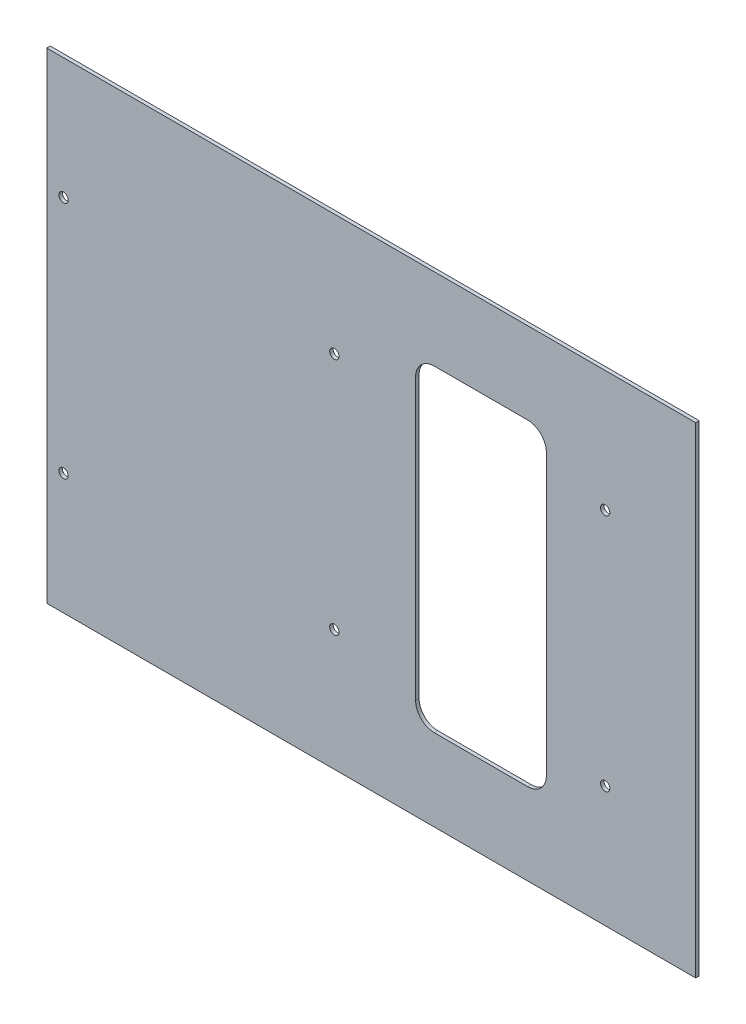
ISO-10303-21;
HEADER;
FILE_DESCRIPTION(('STEP AP214'),'2;1');
FILE_NAME('part.step','',(''),(''),'','','');
FILE_SCHEMA(('AUTOMOTIVE_DESIGN { 1 0 10303 214 1 1 1 1 }'));
ENDSEC;
DATA;
#1=APPLICATION_CONTEXT('core data for automotive mechanical design processes');
#2=APPLICATION_PROTOCOL_DEFINITION('international standard','automotive_design',2000,#1);
#3=PRODUCT_CONTEXT('',#1,'mechanical');
#4=PRODUCT('Part','Part','',(#3));
#5=PRODUCT_RELATED_PRODUCT_CATEGORY('part','',(#4));
#6=PRODUCT_DEFINITION_FORMATION('','',#4);
#7=PRODUCT_DEFINITION_CONTEXT('part definition',#1,'design');
#8=PRODUCT_DEFINITION('design','',#6,#7);
#9=PRODUCT_DEFINITION_SHAPE('','',#8);
#10=(LENGTH_UNIT() NAMED_UNIT(*) SI_UNIT(.MILLI.,.METRE.));
#11=(NAMED_UNIT(*) PLANE_ANGLE_UNIT() SI_UNIT($,.RADIAN.));
#12=(NAMED_UNIT(*) SI_UNIT($,.STERADIAN.) SOLID_ANGLE_UNIT());
#13=UNCERTAINTY_MEASURE_WITH_UNIT(LENGTH_MEASURE(1.E-05),#10,'distance_accuracy_value','');
#14=(GEOMETRIC_REPRESENTATION_CONTEXT(3) GLOBAL_UNCERTAINTY_ASSIGNED_CONTEXT((#13)) GLOBAL_UNIT_ASSIGNED_CONTEXT((#10,
#11,#12)) REPRESENTATION_CONTEXT('',''));
#15=CARTESIAN_POINT('',(0.,0.,0.));
#16=DIRECTION('',(0.,0.,1.));
#17=DIRECTION('',(1.,0.,0.));
#18=AXIS2_PLACEMENT_3D('',#15,#16,#17);
#19=CARTESIAN_POINT('',(-393.700000000001,-235.425000000004,4.7625));
#20=DIRECTION('',(-1.,0.,0.));
#21=DIRECTION('',(0.,0.,1.));
#22=AXIS2_PLACEMENT_3D('',#19,#20,#21);
#23=PLANE('',#22);
#24=DIRECTION('',(0.,1.,0.));
#25=VECTOR('',#24,1.);
#26=CARTESIAN_POINT('',(-393.700000000001,-235.425000000004,0.));
#27=LINE('',#26,#25);
#28=CARTESIAN_POINT('',(-393.700000000001,-235.425000000004,0.));
#29=VERTEX_POINT('',#28);
#30=CARTESIAN_POINT('',(-393.700000000001,418.624999999996,0.));
#31=VERTEX_POINT('',#30);
#32=EDGE_CURVE('E144',#29,#31,#27,.T.);
#33=ORIENTED_EDGE('',*,*,#32,.T.);
#34=DIRECTION('',(0.,0.,-1.));
#35=VECTOR('',#34,1.);
#36=CARTESIAN_POINT('',(-393.700000000001,418.624999999996,4.7625));
#37=LINE('',#36,#35);
#38=CARTESIAN_POINT('',(-393.700000000001,418.624999999996,4.7625));
#39=VERTEX_POINT('',#38);
#40=EDGE_CURVE('E125',#39,#31,#37,.T.);
#41=ORIENTED_EDGE('',*,*,#40,.F.);
#42=DIRECTION('',(0.,1.,0.));
#43=VECTOR('',#42,1.);
#44=CARTESIAN_POINT('',(-393.700000000001,-235.425000000004,4.7625));
#45=LINE('',#44,#43);
#46=CARTESIAN_POINT('',(-393.700000000001,-235.425000000004,4.7625));
#47=VERTEX_POINT('',#46);
#48=EDGE_CURVE('E132',#47,#39,#45,.T.);
#49=ORIENTED_EDGE('',*,*,#48,.F.);
#50=DIRECTION('',(0.,0.,-1.));
#51=VECTOR('',#50,1.);
#52=CARTESIAN_POINT('',(-393.700000000001,-235.425000000004,4.7625));
#53=LINE('',#52,#51);
#54=EDGE_CURVE('E253',#47,#29,#53,.T.);
#55=ORIENTED_EDGE('',*,*,#54,.T.);
#56=EDGE_LOOP('',(#33,#41,#49,#55));
#57=FACE_BOUND('',#56,.T.);
#58=ADVANCED_FACE('F32',(#57),#23,.F.);
#59=CARTESIAN_POINT('',(-393.700000000001,418.624999999996,4.7625));
#60=DIRECTION('',(0.,-1.,0.));
#61=DIRECTION('',(1.,0.,0.));
#62=AXIS2_PLACEMENT_3D('',#59,#60,#61);
#63=PLANE('',#62);
#64=DIRECTION('',(-1.,0.,0.));
#65=VECTOR('',#64,1.);
#66=CARTESIAN_POINT('',(-393.700000000001,418.624999999996,0.));
#67=LINE('',#66,#65);
#68=CARTESIAN_POINT('',(-1276.35,418.624999999996,0.));
#69=VERTEX_POINT('',#68);
#70=EDGE_CURVE('E255',#31,#69,#67,.T.);
#71=ORIENTED_EDGE('',*,*,#70,.T.);
#72=DIRECTION('',(0.,0.,-1.));
#73=VECTOR('',#72,1.);
#74=CARTESIAN_POINT('',(-1276.35,418.624999999996,4.7625));
#75=LINE('',#74,#73);
#76=CARTESIAN_POINT('',(-1276.35,418.624999999996,4.7625));
#77=VERTEX_POINT('',#76);
#78=EDGE_CURVE('E128',#77,#69,#75,.T.);
#79=ORIENTED_EDGE('',*,*,#78,.F.);
#80=DIRECTION('',(-1.,0.,0.));
#81=VECTOR('',#80,1.);
#82=CARTESIAN_POINT('',(-393.700000000001,418.624999999996,4.7625));
#83=LINE('',#82,#81);
#84=EDGE_CURVE('E121',#39,#77,#83,.T.);
#85=ORIENTED_EDGE('',*,*,#84,.F.);
#86=ORIENTED_EDGE('',*,*,#40,.T.);
#87=EDGE_LOOP('',(#71,#79,#85,#86));
#88=FACE_BOUND('',#87,.T.);
#89=ADVANCED_FACE('F123',(#88),#63,.F.);
#90=CARTESIAN_POINT('',(-1276.35,-235.425000000004,4.7625));
#91=DIRECTION('',(1.,0.,0.));
#92=DIRECTION('',(0.,0.,-1.));
#93=AXIS2_PLACEMENT_3D('',#90,#91,#92);
#94=PLANE('',#93);
#95=DIRECTION('',(0.,-1.,0.));
#96=VECTOR('',#95,1.);
#97=CARTESIAN_POINT('',(-1276.35,-235.425000000004,0.));
#98=LINE('',#97,#96);
#99=CARTESIAN_POINT('',(-1276.35,-235.425000000004,0.));
#100=VERTEX_POINT('',#99);
#101=EDGE_CURVE('E257',#69,#100,#98,.T.);
#102=ORIENTED_EDGE('',*,*,#101,.T.);
#103=DIRECTION('',(0.,0.,-1.));
#104=VECTOR('',#103,1.);
#105=CARTESIAN_POINT('',(-1276.35,-235.425000000004,4.7625));
#106=LINE('',#105,#104);
#107=CARTESIAN_POINT('',(-1276.35,-235.425000000004,4.7625));
#108=VERTEX_POINT('',#107);
#109=EDGE_CURVE('E149',#108,#100,#106,.T.);
#110=ORIENTED_EDGE('',*,*,#109,.F.);
#111=DIRECTION('',(0.,-1.,0.));
#112=VECTOR('',#111,1.);
#113=CARTESIAN_POINT('',(-1276.35,-235.425000000004,4.7625));
#114=LINE('',#113,#112);
#115=EDGE_CURVE('E131',#77,#108,#114,.T.);
#116=ORIENTED_EDGE('',*,*,#115,.F.);
#117=ORIENTED_EDGE('',*,*,#78,.T.);
#118=EDGE_LOOP('',(#102,#110,#116,#117));
#119=FACE_BOUND('',#118,.T.);
#120=ADVANCED_FACE('F269',(#119),#94,.F.);
#121=CARTESIAN_POINT('',(-393.700000000001,-235.425000000004,4.7625));
#122=DIRECTION('',(0.,1.,0.));
#123=DIRECTION('',(-1.,0.,0.));
#124=AXIS2_PLACEMENT_3D('',#121,#122,#123);
#125=PLANE('',#124);
#126=DIRECTION('',(1.,0.,0.));
#127=VECTOR('',#126,1.);
#128=CARTESIAN_POINT('',(-393.700000000001,-235.425000000004,0.));
#129=LINE('',#128,#127);
#130=EDGE_CURVE('E141',#100,#29,#129,.T.);
#131=ORIENTED_EDGE('',*,*,#130,.T.);
#132=ORIENTED_EDGE('',*,*,#54,.F.);
#133=DIRECTION('',(1.,0.,0.));
#134=VECTOR('',#133,1.);
#135=CARTESIAN_POINT('',(-393.700000000001,-235.425000000004,4.7625));
#136=LINE('',#135,#134);
#137=EDGE_CURVE('E137',#108,#47,#136,.T.);
#138=ORIENTED_EDGE('',*,*,#137,.F.);
#139=ORIENTED_EDGE('',*,*,#109,.T.);
#140=EDGE_LOOP('',(#131,#132,#138,#139));
#141=FACE_BOUND('',#140,.T.);
#142=ADVANCED_FACE('F264',(#141),#125,.F.);
#143=CARTESIAN_POINT('',(-393.700000000001,418.624999999996,4.7625));
#144=DIRECTION('',(0.,0.,1.));
#145=DIRECTION('',(1.,0.,0.));
#146=AXIS2_PLACEMENT_3D('',#143,#144,#145);
#147=PLANE('',#146);
#148=DIRECTION('',(0.,1.,0.));
#149=VECTOR('',#148,1.);
#150=CARTESIAN_POINT('',(-596.900000000001,307.499999999996,4.7625));
#151=LINE('',#150,#149);
#152=CARTESIAN_POINT('',(-596.900000000001,-98.900000000004,4.7625));
#153=VERTEX_POINT('',#152);
#154=CARTESIAN_POINT('',(-596.900000000001,282.099999999996,4.7625));
#155=VERTEX_POINT('',#154);
#156=EDGE_CURVE('E185',#153,#155,#151,.T.);
#157=ORIENTED_EDGE('',*,*,#156,.F.);
#158=CARTESIAN_POINT('',(-622.300000000001,-98.9000000000041,4.7625));
#159=DIRECTION('',(0.,0.,1.));
#160=DIRECTION('',(1.,0.,0.));
#161=AXIS2_PLACEMENT_3D('',#158,#159,#160);
#162=CIRCLE('',#161,25.4);
#163=CARTESIAN_POINT('',(-622.300000000001,-124.300000000004,4.7625));
#164=VERTEX_POINT('',#163);
#165=EDGE_CURVE('E173',#153,#164,#162,.F.);
#166=ORIENTED_EDGE('',*,*,#165,.T.);
#167=DIRECTION('',(1.,0.,0.));
#168=VECTOR('',#167,1.);
#169=CARTESIAN_POINT('',(-596.900000000001,-124.300000000004,4.7625));
#170=LINE('',#169,#168);
#171=CARTESIAN_POINT('',(-749.300000000001,-124.300000000004,4.7625));
#172=VERTEX_POINT('',#171);
#173=EDGE_CURVE('E204',#172,#164,#170,.T.);
#174=ORIENTED_EDGE('',*,*,#173,.F.);
#175=CARTESIAN_POINT('',(-749.300000000001,-98.9000000000041,4.7625));
#176=DIRECTION('',(0.,0.,1.));
#177=DIRECTION('',(1.,0.,0.));
#178=AXIS2_PLACEMENT_3D('',#175,#176,#177);
#179=CIRCLE('',#178,25.4);
#180=CARTESIAN_POINT('',(-774.700000000001,-98.9000000000042,4.7625));
#181=VERTEX_POINT('',#180);
#182=EDGE_CURVE('E169',#172,#181,#179,.F.);
#183=ORIENTED_EDGE('',*,*,#182,.T.);
#184=DIRECTION('',(0.,-1.,0.));
#185=VECTOR('',#184,1.);
#186=CARTESIAN_POINT('',(-774.700000000001,307.499999999996,4.7625));
#187=LINE('',#186,#185);
#188=CARTESIAN_POINT('',(-774.700000000001,282.099999999996,4.7625));
#189=VERTEX_POINT('',#188);
#190=EDGE_CURVE('E211',#189,#181,#187,.T.);
#191=ORIENTED_EDGE('',*,*,#190,.F.);
#192=CARTESIAN_POINT('',(-749.300000000001,282.099999999996,4.7625));
#193=DIRECTION('',(0.,0.,1.));
#194=DIRECTION('',(1.,0.,0.));
#195=AXIS2_PLACEMENT_3D('',#192,#193,#194);
#196=CIRCLE('',#195,25.4);
#197=CARTESIAN_POINT('',(-749.300000000001,307.499999999996,4.7625));
#198=VERTEX_POINT('',#197);
#199=EDGE_CURVE('E177',#189,#198,#196,.F.);
#200=ORIENTED_EDGE('',*,*,#199,.T.);
#201=DIRECTION('',(-1.,0.,0.));
#202=VECTOR('',#201,1.);
#203=CARTESIAN_POINT('',(-596.900000000001,307.499999999996,4.7625));
#204=LINE('',#203,#202);
#205=CARTESIAN_POINT('',(-622.300000000001,307.499999999996,4.7625));
#206=VERTEX_POINT('',#205);
#207=EDGE_CURVE('E186',#206,#198,#204,.T.);
#208=ORIENTED_EDGE('',*,*,#207,.F.);
#209=CARTESIAN_POINT('',(-622.300000000001,282.099999999996,4.7625));
#210=DIRECTION('',(0.,0.,1.));
#211=DIRECTION('',(1.,0.,0.));
#212=AXIS2_PLACEMENT_3D('',#209,#210,#211);
#213=CIRCLE('',#212,25.4);
#214=EDGE_CURVE('E40',#206,#155,#213,.F.);
#215=ORIENTED_EDGE('',*,*,#214,.T.);
#216=EDGE_LOOP('',(#157,#166,#174,#183,#191,#200,#208,#215));
#217=FACE_BOUND('',#216,.T.);
#218=CARTESIAN_POINT('',(-1253.49,253.999999999993,4.7625));
#219=DIRECTION('',(0.,0.,-1.));
#220=DIRECTION('',(-1.,0.,0.));
#221=AXIS2_PLACEMENT_3D('',#218,#219,#220);
#222=CIRCLE('',#221,6.35000000000017);
#223=CARTESIAN_POINT('',(-1259.84,253.999999999993,4.7625));
#224=VERTEX_POINT('',#223);
#225=EDGE_CURVE('E216',#224,#224,#222,.T.);
#226=ORIENTED_EDGE('',*,*,#225,.T.);
#227=EDGE_LOOP('',(#226));
#228=FACE_BOUND('',#227,.T.);
#229=CARTESIAN_POINT('',(-1253.49,-70.8000000000146,4.7625));
#230=DIRECTION('',(0.,0.,-1.));
#231=DIRECTION('',(-1.,0.,0.));
#232=AXIS2_PLACEMENT_3D('',#229,#230,#231);
#233=CIRCLE('',#232,6.35000000000016);
#234=CARTESIAN_POINT('',(-1259.84,-70.8000000000146,4.7625));
#235=VERTEX_POINT('',#234);
#236=EDGE_CURVE('E222',#235,#235,#233,.T.);
#237=ORIENTED_EDGE('',*,*,#236,.T.);
#238=EDGE_LOOP('',(#237));
#239=FACE_BOUND('',#238,.T.);
#240=CARTESIAN_POINT('',(-885.190000000002,-70.8000000000146,4.7625));
#241=DIRECTION('',(0.,0.,-1.));
#242=DIRECTION('',(-1.,0.,0.));
#243=AXIS2_PLACEMENT_3D('',#240,#241,#242);
#244=CIRCLE('',#243,6.35000000000006);
#245=CARTESIAN_POINT('',(-891.540000000002,-70.8000000000146,4.7625));
#246=VERTEX_POINT('',#245);
#247=EDGE_CURVE('E228',#246,#246,#244,.T.);
#248=ORIENTED_EDGE('',*,*,#247,.T.);
#249=EDGE_LOOP('',(#248));
#250=FACE_BOUND('',#249,.T.);
#251=CARTESIAN_POINT('',(-885.19,253.999999999993,4.7625));
#252=DIRECTION('',(0.,0.,-1.));
#253=DIRECTION('',(-1.,0.,0.));
#254=AXIS2_PLACEMENT_3D('',#251,#252,#253);
#255=CIRCLE('',#254,6.34999999999994);
#256=CARTESIAN_POINT('',(-891.54,253.999999999993,4.7625));
#257=VERTEX_POINT('',#256);
#258=EDGE_CURVE('E234',#257,#257,#255,.T.);
#259=ORIENTED_EDGE('',*,*,#258,.T.);
#260=EDGE_LOOP('',(#259));
#261=FACE_BOUND('',#260,.T.);
#262=CARTESIAN_POINT('',(-516.890000000002,-70.8000000000146,4.7625));
#263=DIRECTION('',(0.,0.,-1.));
#264=DIRECTION('',(-1.,0.,0.));
#265=AXIS2_PLACEMENT_3D('',#262,#263,#264);
#266=CIRCLE('',#265,6.34999999999994);
#267=CARTESIAN_POINT('',(-523.240000000002,-70.8000000000146,4.7625));
#268=VERTEX_POINT('',#267);
#269=EDGE_CURVE('E240',#268,#268,#266,.T.);
#270=ORIENTED_EDGE('',*,*,#269,.T.);
#271=EDGE_LOOP('',(#270));
#272=FACE_BOUND('',#271,.T.);
#273=CARTESIAN_POINT('',(-516.89,253.999999999993,4.7625));
#274=DIRECTION('',(0.,0.,-1.));
#275=DIRECTION('',(-1.,0.,0.));
#276=AXIS2_PLACEMENT_3D('',#273,#274,#275);
#277=CIRCLE('',#276,6.34999999999994);
#278=CARTESIAN_POINT('',(-523.24,253.999999999993,4.7625));
#279=VERTEX_POINT('',#278);
#280=EDGE_CURVE('E246',#279,#279,#277,.T.);
#281=ORIENTED_EDGE('',*,*,#280,.T.);
#282=EDGE_LOOP('',(#281));
#283=FACE_BOUND('',#282,.T.);
#284=ORIENTED_EDGE('',*,*,#48,.T.);
#285=ORIENTED_EDGE('',*,*,#84,.T.);
#286=ORIENTED_EDGE('',*,*,#115,.T.);
#287=ORIENTED_EDGE('',*,*,#137,.T.);
#288=EDGE_LOOP('',(#284,#285,#286,#287));
#289=FACE_BOUND('',#288,.T.);
#290=ADVANCED_FACE('F135',(#217,#228,#239,#250,#261,#272,#283,#289),#147,.T.);
#291=CARTESIAN_POINT('',(-393.700000000001,418.624999999996,0.));
#292=DIRECTION('',(0.,0.,1.));
#293=DIRECTION('',(1.,0.,0.));
#294=AXIS2_PLACEMENT_3D('',#291,#292,#293);
#295=PLANE('',#294);
#296=DIRECTION('',(0.,-1.,0.));
#297=VECTOR('',#296,1.);
#298=CARTESIAN_POINT('',(-774.700000000001,307.499999999996,0.));
#299=LINE('',#298,#297);
#300=CARTESIAN_POINT('',(-774.700000000001,282.099999999996,0.));
#301=VERTEX_POINT('',#300);
#302=CARTESIAN_POINT('',(-774.700000000001,-98.9000000000042,0.));
#303=VERTEX_POINT('',#302);
#304=EDGE_CURVE('E198',#301,#303,#299,.T.);
#305=ORIENTED_EDGE('',*,*,#304,.T.);
#306=CARTESIAN_POINT('',(-749.300000000001,-98.9000000000041,0.));
#307=DIRECTION('',(0.,0.,1.));
#308=DIRECTION('',(1.,0.,0.));
#309=AXIS2_PLACEMENT_3D('',#306,#307,#308);
#310=CIRCLE('',#309,25.4);
#311=CARTESIAN_POINT('',(-749.300000000001,-124.300000000004,0.));
#312=VERTEX_POINT('',#311);
#313=EDGE_CURVE('E171',#303,#312,#310,.T.);
#314=ORIENTED_EDGE('',*,*,#313,.T.);
#315=DIRECTION('',(1.,0.,0.));
#316=VECTOR('',#315,1.);
#317=CARTESIAN_POINT('',(-596.900000000001,-124.300000000004,0.));
#318=LINE('',#317,#316);
#319=CARTESIAN_POINT('',(-622.300000000001,-124.300000000004,0.));
#320=VERTEX_POINT('',#319);
#321=EDGE_CURVE('E202',#312,#320,#318,.T.);
#322=ORIENTED_EDGE('',*,*,#321,.T.);
#323=CARTESIAN_POINT('',(-622.300000000001,-98.9000000000041,0.));
#324=DIRECTION('',(0.,0.,1.));
#325=DIRECTION('',(1.,0.,0.));
#326=AXIS2_PLACEMENT_3D('',#323,#324,#325);
#327=CIRCLE('',#326,25.4);
#328=CARTESIAN_POINT('',(-596.900000000001,-98.900000000004,0.));
#329=VERTEX_POINT('',#328);
#330=EDGE_CURVE('E175',#320,#329,#327,.T.);
#331=ORIENTED_EDGE('',*,*,#330,.T.);
#332=DIRECTION('',(0.,1.,0.));
#333=VECTOR('',#332,1.);
#334=CARTESIAN_POINT('',(-596.900000000001,307.499999999996,0.));
#335=LINE('',#334,#333);
#336=CARTESIAN_POINT('',(-596.900000000001,282.099999999996,0.));
#337=VERTEX_POINT('',#336);
#338=EDGE_CURVE('E199',#329,#337,#335,.T.);
#339=ORIENTED_EDGE('',*,*,#338,.T.);
#340=CARTESIAN_POINT('',(-622.300000000001,282.099999999996,0.));
#341=DIRECTION('',(0.,0.,1.));
#342=DIRECTION('',(1.,0.,0.));
#343=AXIS2_PLACEMENT_3D('',#340,#341,#342);
#344=CIRCLE('',#343,25.4);
#345=CARTESIAN_POINT('',(-622.300000000001,307.499999999996,0.));
#346=VERTEX_POINT('',#345);
#347=EDGE_CURVE('E11',#337,#346,#344,.T.);
#348=ORIENTED_EDGE('',*,*,#347,.T.);
#349=DIRECTION('',(-1.,0.,0.));
#350=VECTOR('',#349,1.);
#351=CARTESIAN_POINT('',(-596.900000000001,307.499999999996,0.));
#352=LINE('',#351,#350);
#353=CARTESIAN_POINT('',(-749.300000000001,307.499999999996,0.));
#354=VERTEX_POINT('',#353);
#355=EDGE_CURVE('E196',#346,#354,#352,.T.);
#356=ORIENTED_EDGE('',*,*,#355,.T.);
#357=CARTESIAN_POINT('',(-749.300000000001,282.099999999996,0.));
#358=DIRECTION('',(0.,0.,1.));
#359=DIRECTION('',(1.,0.,0.));
#360=AXIS2_PLACEMENT_3D('',#357,#358,#359);
#361=CIRCLE('',#360,25.4);
#362=EDGE_CURVE('E179',#354,#301,#361,.T.);
#363=ORIENTED_EDGE('',*,*,#362,.T.);
#364=EDGE_LOOP('',(#305,#314,#322,#331,#339,#348,#356,#363));
#365=FACE_BOUND('',#364,.T.);
#366=CARTESIAN_POINT('',(-1253.49,253.999999999993,0.));
#367=DIRECTION('',(0.,0.,-1.));
#368=DIRECTION('',(-1.,0.,0.));
#369=AXIS2_PLACEMENT_3D('',#366,#367,#368);
#370=CIRCLE('',#369,6.35000000000017);
#371=CARTESIAN_POINT('',(-1259.84,253.999999999993,0.));
#372=VERTEX_POINT('',#371);
#373=EDGE_CURVE('E208',#372,#372,#370,.T.);
#374=ORIENTED_EDGE('',*,*,#373,.F.);
#375=EDGE_LOOP('',(#374));
#376=FACE_BOUND('',#375,.T.);
#377=CARTESIAN_POINT('',(-1253.49,-70.8000000000146,0.));
#378=DIRECTION('',(0.,0.,-1.));
#379=DIRECTION('',(-1.,0.,0.));
#380=AXIS2_PLACEMENT_3D('',#377,#378,#379);
#381=CIRCLE('',#380,6.35000000000016);
#382=CARTESIAN_POINT('',(-1259.84,-70.8000000000146,0.));
#383=VERTEX_POINT('',#382);
#384=EDGE_CURVE('E219',#383,#383,#381,.T.);
#385=ORIENTED_EDGE('',*,*,#384,.F.);
#386=EDGE_LOOP('',(#385));
#387=FACE_BOUND('',#386,.T.);
#388=CARTESIAN_POINT('',(-885.190000000002,-70.8000000000146,0.));
#389=DIRECTION('',(0.,0.,-1.));
#390=DIRECTION('',(-1.,0.,0.));
#391=AXIS2_PLACEMENT_3D('',#388,#389,#390);
#392=CIRCLE('',#391,6.35000000000006);
#393=CARTESIAN_POINT('',(-891.540000000002,-70.8000000000146,0.));
#394=VERTEX_POINT('',#393);
#395=EDGE_CURVE('E225',#394,#394,#392,.T.);
#396=ORIENTED_EDGE('',*,*,#395,.F.);
#397=EDGE_LOOP('',(#396));
#398=FACE_BOUND('',#397,.T.);
#399=CARTESIAN_POINT('',(-885.19,253.999999999993,0.));
#400=DIRECTION('',(0.,0.,-1.));
#401=DIRECTION('',(-1.,0.,0.));
#402=AXIS2_PLACEMENT_3D('',#399,#400,#401);
#403=CIRCLE('',#402,6.34999999999994);
#404=CARTESIAN_POINT('',(-891.54,253.999999999993,0.));
#405=VERTEX_POINT('',#404);
#406=EDGE_CURVE('E231',#405,#405,#403,.T.);
#407=ORIENTED_EDGE('',*,*,#406,.F.);
#408=EDGE_LOOP('',(#407));
#409=FACE_BOUND('',#408,.T.);
#410=CARTESIAN_POINT('',(-516.890000000002,-70.8000000000146,0.));
#411=DIRECTION('',(0.,0.,-1.));
#412=DIRECTION('',(-1.,0.,0.));
#413=AXIS2_PLACEMENT_3D('',#410,#411,#412);
#414=CIRCLE('',#413,6.34999999999994);
#415=CARTESIAN_POINT('',(-523.240000000002,-70.8000000000146,0.));
#416=VERTEX_POINT('',#415);
#417=EDGE_CURVE('E237',#416,#416,#414,.T.);
#418=ORIENTED_EDGE('',*,*,#417,.F.);
#419=EDGE_LOOP('',(#418));
#420=FACE_BOUND('',#419,.T.);
#421=CARTESIAN_POINT('',(-516.89,253.999999999993,0.));
#422=DIRECTION('',(0.,0.,-1.));
#423=DIRECTION('',(-1.,0.,0.));
#424=AXIS2_PLACEMENT_3D('',#421,#422,#423);
#425=CIRCLE('',#424,6.34999999999994);
#426=CARTESIAN_POINT('',(-523.24,253.999999999993,0.));
#427=VERTEX_POINT('',#426);
#428=EDGE_CURVE('E243',#427,#427,#425,.T.);
#429=ORIENTED_EDGE('',*,*,#428,.F.);
#430=EDGE_LOOP('',(#429));
#431=FACE_BOUND('',#430,.T.);
#432=ORIENTED_EDGE('',*,*,#32,.F.);
#433=ORIENTED_EDGE('',*,*,#130,.F.);
#434=ORIENTED_EDGE('',*,*,#101,.F.);
#435=ORIENTED_EDGE('',*,*,#70,.F.);
#436=EDGE_LOOP('',(#432,#433,#434,#435));
#437=FACE_BOUND('',#436,.T.);
#438=ADVANCED_FACE('F268',(#365,#376,#387,#398,#409,#420,#431,#437),#295,.F.);
#439=CARTESIAN_POINT('',(-516.89,253.999999999993,4.7625));
#440=DIRECTION('',(0.,0.,-1.));
#441=DIRECTION('',(-1.,0.,0.));
#442=AXIS2_PLACEMENT_3D('',#439,#440,#441);
#443=CYLINDRICAL_SURFACE('',#442,6.34999999999994);
#444=ORIENTED_EDGE('',*,*,#280,.F.);
#445=EDGE_LOOP('',(#444));
#446=FACE_BOUND('',#445,.T.);
#447=ORIENTED_EDGE('',*,*,#428,.T.);
#448=EDGE_LOOP('',(#447));
#449=FACE_BOUND('',#448,.T.);
#450=ADVANCED_FACE('F341',(#446,#449),#443,.F.);
#451=CARTESIAN_POINT('',(-516.890000000002,-70.8000000000146,4.7625));
#452=DIRECTION('',(0.,0.,-1.));
#453=DIRECTION('',(-1.,0.,0.));
#454=AXIS2_PLACEMENT_3D('',#451,#452,#453);
#455=CYLINDRICAL_SURFACE('',#454,6.34999999999994);
#456=ORIENTED_EDGE('',*,*,#269,.F.);
#457=EDGE_LOOP('',(#456));
#458=FACE_BOUND('',#457,.T.);
#459=ORIENTED_EDGE('',*,*,#417,.T.);
#460=EDGE_LOOP('',(#459));
#461=FACE_BOUND('',#460,.T.);
#462=ADVANCED_FACE('F337',(#458,#461),#455,.F.);
#463=CARTESIAN_POINT('',(-885.19,253.999999999993,4.7625));
#464=DIRECTION('',(0.,0.,-1.));
#465=DIRECTION('',(-1.,0.,0.));
#466=AXIS2_PLACEMENT_3D('',#463,#464,#465);
#467=CYLINDRICAL_SURFACE('',#466,6.34999999999994);
#468=ORIENTED_EDGE('',*,*,#258,.F.);
#469=EDGE_LOOP('',(#468));
#470=FACE_BOUND('',#469,.T.);
#471=ORIENTED_EDGE('',*,*,#406,.T.);
#472=EDGE_LOOP('',(#471));
#473=FACE_BOUND('',#472,.T.);
#474=ADVANCED_FACE('F333',(#470,#473),#467,.F.);
#475=CARTESIAN_POINT('',(-885.190000000002,-70.8000000000146,4.7625));
#476=DIRECTION('',(0.,0.,-1.));
#477=DIRECTION('',(-1.,0.,0.));
#478=AXIS2_PLACEMENT_3D('',#475,#476,#477);
#479=CYLINDRICAL_SURFACE('',#478,6.35000000000006);
#480=ORIENTED_EDGE('',*,*,#247,.F.);
#481=EDGE_LOOP('',(#480));
#482=FACE_BOUND('',#481,.T.);
#483=ORIENTED_EDGE('',*,*,#395,.T.);
#484=EDGE_LOOP('',(#483));
#485=FACE_BOUND('',#484,.T.);
#486=ADVANCED_FACE('F329',(#482,#485),#479,.F.);
#487=CARTESIAN_POINT('',(-1253.49,-70.8000000000146,4.7625));
#488=DIRECTION('',(0.,0.,-1.));
#489=DIRECTION('',(-1.,0.,0.));
#490=AXIS2_PLACEMENT_3D('',#487,#488,#489);
#491=CYLINDRICAL_SURFACE('',#490,6.35000000000016);
#492=ORIENTED_EDGE('',*,*,#236,.F.);
#493=EDGE_LOOP('',(#492));
#494=FACE_BOUND('',#493,.T.);
#495=ORIENTED_EDGE('',*,*,#384,.T.);
#496=EDGE_LOOP('',(#495));
#497=FACE_BOUND('',#496,.T.);
#498=ADVANCED_FACE('F325',(#494,#497),#491,.F.);
#499=CARTESIAN_POINT('',(-1253.49,253.999999999993,4.7625));
#500=DIRECTION('',(0.,0.,-1.));
#501=DIRECTION('',(-1.,0.,0.));
#502=AXIS2_PLACEMENT_3D('',#499,#500,#501);
#503=CYLINDRICAL_SURFACE('',#502,6.35000000000017);
#504=ORIENTED_EDGE('',*,*,#225,.F.);
#505=EDGE_LOOP('',(#504));
#506=FACE_BOUND('',#505,.T.);
#507=ORIENTED_EDGE('',*,*,#373,.T.);
#508=EDGE_LOOP('',(#507));
#509=FACE_BOUND('',#508,.T.);
#510=ADVANCED_FACE('F318',(#506,#509),#503,.F.);
#511=CARTESIAN_POINT('',(-596.900000000001,307.499999999996,0.));
#512=DIRECTION('',(1.,0.,0.));
#513=DIRECTION('',(0.,0.,-1.));
#514=AXIS2_PLACEMENT_3D('',#511,#512,#513);
#515=PLANE('',#514);
#516=ORIENTED_EDGE('',*,*,#338,.F.);
#517=DIRECTION('',(0.,0.,1.));
#518=VECTOR('',#517,1.);
#519=CARTESIAN_POINT('',(-596.900000000001,-98.9000000000041,4.7625));
#520=LINE('',#519,#518);
#521=EDGE_CURVE('E162',#329,#153,#520,.T.);
#522=ORIENTED_EDGE('',*,*,#521,.T.);
#523=ORIENTED_EDGE('',*,*,#156,.T.);
#524=DIRECTION('',(0.,0.,1.));
#525=VECTOR('',#524,1.);
#526=CARTESIAN_POINT('',(-596.900000000001,282.099999999996,0.));
#527=LINE('',#526,#525);
#528=EDGE_CURVE('E160',#155,#337,#527,.F.);
#529=ORIENTED_EDGE('',*,*,#528,.T.);
#530=EDGE_LOOP('',(#516,#522,#523,#529));
#531=FACE_BOUND('',#530,.T.);
#532=ADVANCED_FACE('F192',(#531),#515,.F.);
#533=CARTESIAN_POINT('',(-596.900000000001,-124.300000000004,0.));
#534=DIRECTION('',(0.,-1.,0.));
#535=DIRECTION('',(1.,0.,0.));
#536=AXIS2_PLACEMENT_3D('',#533,#534,#535);
#537=PLANE('',#536);
#538=ORIENTED_EDGE('',*,*,#321,.F.);
#539=DIRECTION('',(0.,0.,1.));
#540=VECTOR('',#539,1.);
#541=CARTESIAN_POINT('',(-749.300000000001,-124.300000000004,4.7625));
#542=LINE('',#541,#540);
#543=EDGE_CURVE('E147',#312,#172,#542,.T.);
#544=ORIENTED_EDGE('',*,*,#543,.T.);
#545=ORIENTED_EDGE('',*,*,#173,.T.);
#546=DIRECTION('',(0.,0.,1.));
#547=VECTOR('',#546,1.);
#548=CARTESIAN_POINT('',(-622.300000000001,-124.300000000004,0.));
#549=LINE('',#548,#547);
#550=EDGE_CURVE('E145',#164,#320,#549,.F.);
#551=ORIENTED_EDGE('',*,*,#550,.T.);
#552=EDGE_LOOP('',(#538,#544,#545,#551));
#553=FACE_BOUND('',#552,.T.);
#554=ADVANCED_FACE('F308',(#553),#537,.F.);
#555=CARTESIAN_POINT('',(-774.700000000001,307.499999999996,0.));
#556=DIRECTION('',(-1.,0.,0.));
#557=DIRECTION('',(0.,0.,1.));
#558=AXIS2_PLACEMENT_3D('',#555,#556,#557);
#559=PLANE('',#558);
#560=ORIENTED_EDGE('',*,*,#190,.T.);
#561=DIRECTION('',(0.,0.,1.));
#562=VECTOR('',#561,1.);
#563=CARTESIAN_POINT('',(-774.700000000001,-98.9000000000041,0.));
#564=LINE('',#563,#562);
#565=EDGE_CURVE('E158',#181,#303,#564,.F.);
#566=ORIENTED_EDGE('',*,*,#565,.T.);
#567=ORIENTED_EDGE('',*,*,#304,.F.);
#568=DIRECTION('',(0.,0.,1.));
#569=VECTOR('',#568,1.);
#570=CARTESIAN_POINT('',(-774.700000000001,282.099999999996,4.7625));
#571=LINE('',#570,#569);
#572=EDGE_CURVE('E155',#301,#189,#571,.T.);
#573=ORIENTED_EDGE('',*,*,#572,.T.);
#574=EDGE_LOOP('',(#560,#566,#567,#573));
#575=FACE_BOUND('',#574,.T.);
#576=ADVANCED_FACE('F301',(#575),#559,.F.);
#577=CARTESIAN_POINT('',(-596.900000000001,307.499999999996,0.));
#578=DIRECTION('',(0.,1.,0.));
#579=DIRECTION('',(-1.,0.,0.));
#580=AXIS2_PLACEMENT_3D('',#577,#578,#579);
#581=PLANE('',#580);
#582=ORIENTED_EDGE('',*,*,#207,.T.);
#583=DIRECTION('',(0.,0.,1.));
#584=VECTOR('',#583,1.);
#585=CARTESIAN_POINT('',(-749.300000000001,307.499999999996,0.));
#586=LINE('',#585,#584);
#587=EDGE_CURVE('E47',#198,#354,#586,.F.);
#588=ORIENTED_EDGE('',*,*,#587,.T.);
#589=ORIENTED_EDGE('',*,*,#355,.F.);
#590=DIRECTION('',(0.,0.,1.));
#591=VECTOR('',#590,1.);
#592=CARTESIAN_POINT('',(-622.300000000001,307.499999999996,4.7625));
#593=LINE('',#592,#591);
#594=EDGE_CURVE('E165',#346,#206,#593,.T.);
#595=ORIENTED_EDGE('',*,*,#594,.T.);
#596=EDGE_LOOP('',(#582,#588,#589,#595));
#597=FACE_BOUND('',#596,.T.);
#598=ADVANCED_FACE('F195',(#597),#581,.F.);
#599=CARTESIAN_POINT('',(-749.300000000001,-98.9000000000041,0.));
#600=DIRECTION('',(0.,0.,-1.));
#601=DIRECTION('',(-1.,0.,0.));
#602=AXIS2_PLACEMENT_3D('',#599,#600,#601);
#603=CYLINDRICAL_SURFACE('',#602,25.4);
#604=ORIENTED_EDGE('',*,*,#313,.F.);
#605=ORIENTED_EDGE('',*,*,#565,.F.);
#606=ORIENTED_EDGE('',*,*,#182,.F.);
#607=ORIENTED_EDGE('',*,*,#543,.F.);
#608=EDGE_LOOP('',(#604,#605,#606,#607));
#609=FACE_BOUND('',#608,.T.);
#610=ADVANCED_FACE('F283',(#609),#603,.F.);
#611=CARTESIAN_POINT('',(-622.300000000001,-98.9000000000041,0.));
#612=DIRECTION('',(0.,0.,-1.));
#613=DIRECTION('',(-1.,0.,0.));
#614=AXIS2_PLACEMENT_3D('',#611,#612,#613);
#615=CYLINDRICAL_SURFACE('',#614,25.4);
#616=ORIENTED_EDGE('',*,*,#330,.F.);
#617=ORIENTED_EDGE('',*,*,#550,.F.);
#618=ORIENTED_EDGE('',*,*,#165,.F.);
#619=ORIENTED_EDGE('',*,*,#521,.F.);
#620=EDGE_LOOP('',(#616,#617,#618,#619));
#621=FACE_BOUND('',#620,.T.);
#622=ADVANCED_FACE('F286',(#621),#615,.F.);
#623=CARTESIAN_POINT('',(-749.300000000001,282.099999999996,0.));
#624=DIRECTION('',(0.,0.,-1.));
#625=DIRECTION('',(-1.,0.,0.));
#626=AXIS2_PLACEMENT_3D('',#623,#624,#625);
#627=CYLINDRICAL_SURFACE('',#626,25.4);
#628=ORIENTED_EDGE('',*,*,#362,.F.);
#629=ORIENTED_EDGE('',*,*,#587,.F.);
#630=ORIENTED_EDGE('',*,*,#199,.F.);
#631=ORIENTED_EDGE('',*,*,#572,.F.);
#632=EDGE_LOOP('',(#628,#629,#630,#631));
#633=FACE_BOUND('',#632,.T.);
#634=ADVANCED_FACE('F289',(#633),#627,.F.);
#635=CARTESIAN_POINT('',(-622.300000000001,282.099999999996,0.));
#636=DIRECTION('',(0.,0.,-1.));
#637=DIRECTION('',(-1.,0.,0.));
#638=AXIS2_PLACEMENT_3D('',#635,#636,#637);
#639=CYLINDRICAL_SURFACE('',#638,25.4);
#640=ORIENTED_EDGE('',*,*,#347,.F.);
#641=ORIENTED_EDGE('',*,*,#528,.F.);
#642=ORIENTED_EDGE('',*,*,#214,.F.);
#643=ORIENTED_EDGE('',*,*,#594,.F.);
#644=EDGE_LOOP('',(#640,#641,#642,#643));
#645=FACE_BOUND('',#644,.T.);
#646=ADVANCED_FACE('F34',(#645),#639,.F.);
#647=CLOSED_SHELL('',(#58,#89,#120,#142,#290,#438,#450,#462,#474,#486,#498,#510,#532,#554,#576,
#598,#610,#622,#634,#646));
#648=MANIFOLD_SOLID_BREP('B2',#647);
#649=ADVANCED_BREP_SHAPE_REPRESENTATION('',(#18,#648),#14);
#650=SHAPE_DEFINITION_REPRESENTATION(#9,#649);
ENDSEC;
END-ISO-10303-21;
